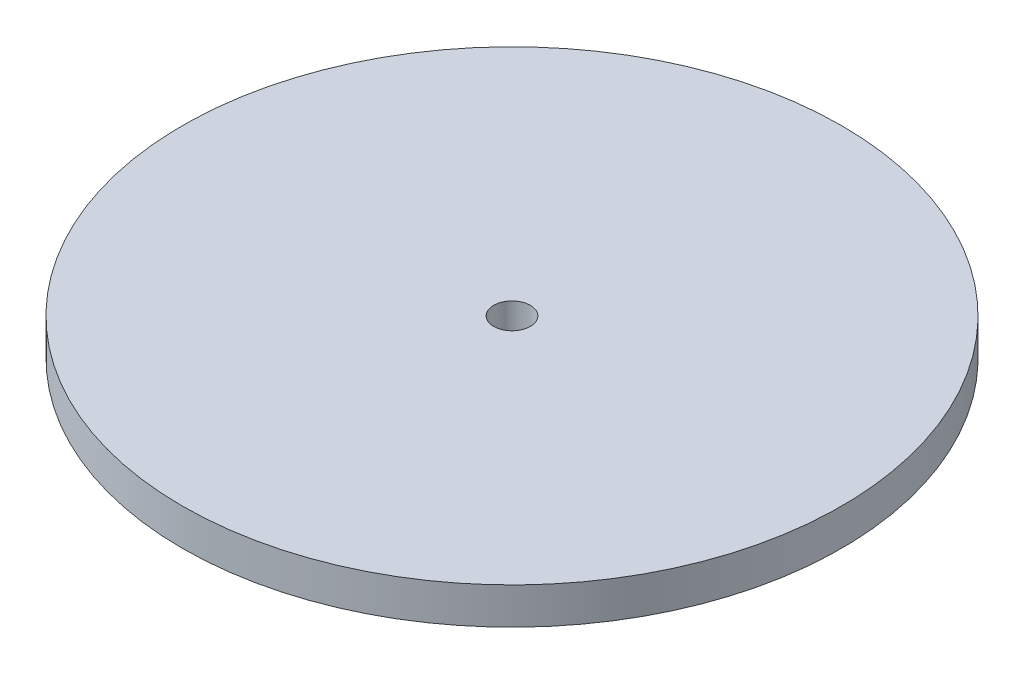
ISO-10303-21;
HEADER;
FILE_DESCRIPTION(('STEP AP214'),'2;1');
FILE_NAME('part.step','',(''),(''),'','','');
FILE_SCHEMA(('AUTOMOTIVE_DESIGN { 1 0 10303 214 1 1 1 1 }'));
ENDSEC;
DATA;
#1=APPLICATION_CONTEXT('core data for automotive mechanical design processes');
#2=APPLICATION_PROTOCOL_DEFINITION('international standard','automotive_design',2000,#1);
#3=PRODUCT_CONTEXT('',#1,'mechanical');
#4=PRODUCT('Part','Part','',(#3));
#5=PRODUCT_RELATED_PRODUCT_CATEGORY('part','',(#4));
#6=PRODUCT_DEFINITION_FORMATION('','',#4);
#7=PRODUCT_DEFINITION_CONTEXT('part definition',#1,'design');
#8=PRODUCT_DEFINITION('design','',#6,#7);
#9=PRODUCT_DEFINITION_SHAPE('','',#8);
#10=(LENGTH_UNIT() NAMED_UNIT(*) SI_UNIT(.MILLI.,.METRE.));
#11=(NAMED_UNIT(*) PLANE_ANGLE_UNIT() SI_UNIT($,.RADIAN.));
#12=(NAMED_UNIT(*) SI_UNIT($,.STERADIAN.) SOLID_ANGLE_UNIT());
#13=UNCERTAINTY_MEASURE_WITH_UNIT(LENGTH_MEASURE(1.E-05),#10,'distance_accuracy_value','');
#14=(GEOMETRIC_REPRESENTATION_CONTEXT(3) GLOBAL_UNCERTAINTY_ASSIGNED_CONTEXT((#13)) GLOBAL_UNIT_ASSIGNED_CONTEXT((#10,
#11,#12)) REPRESENTATION_CONTEXT('',''));
#15=CARTESIAN_POINT('',(0.,0.,0.));
#16=DIRECTION('',(0.,0.,1.));
#17=DIRECTION('',(1.,0.,0.));
#18=AXIS2_PLACEMENT_3D('',#15,#16,#17);
#19=CARTESIAN_POINT('',(0.,10.,0.));
#20=DIRECTION('',(0.,-1.,0.));
#21=DIRECTION('',(0.,0.,-1.));
#22=AXIS2_PLACEMENT_3D('',#19,#20,#21);
#23=CYLINDRICAL_SURFACE('',#22,90.);
#24=CARTESIAN_POINT('',(0.,10.,0.));
#25=DIRECTION('',(0.,1.,0.));
#26=DIRECTION('',(0.,0.,1.));
#27=AXIS2_PLACEMENT_3D('',#24,#25,#26);
#28=CIRCLE('',#27,90.);
#29=CARTESIAN_POINT('',(0.,10.,90.));
#30=VERTEX_POINT('',#29);
#31=EDGE_CURVE('E10',#30,#30,#28,.T.);
#32=ORIENTED_EDGE('',*,*,#31,.F.);
#33=EDGE_LOOP('',(#32));
#34=FACE_BOUND('',#33,.T.);
#35=CARTESIAN_POINT('',(0.,0.,0.));
#36=DIRECTION('',(0.,1.,0.));
#37=DIRECTION('',(0.,0.,1.));
#38=AXIS2_PLACEMENT_3D('',#35,#36,#37);
#39=CIRCLE('',#38,90.);
#40=CARTESIAN_POINT('',(0.,0.,90.));
#41=VERTEX_POINT('',#40);
#42=EDGE_CURVE('E41',#41,#41,#39,.T.);
#43=ORIENTED_EDGE('',*,*,#42,.T.);
#44=EDGE_LOOP('',(#43));
#45=FACE_BOUND('',#44,.T.);
#46=ADVANCED_FACE('F38',(#34,#45),#23,.T.);
#47=CARTESIAN_POINT('',(0.,10.,0.));
#48=DIRECTION('',(0.,1.,0.));
#49=DIRECTION('',(0.,0.,1.));
#50=AXIS2_PLACEMENT_3D('',#47,#48,#49);
#51=PLANE('',#50);
#52=CARTESIAN_POINT('',(0.,10.,0.));
#53=DIRECTION('',(0.,1.,0.));
#54=DIRECTION('',(0.,0.,1.));
#55=AXIS2_PLACEMENT_3D('',#52,#53,#54);
#56=CIRCLE('',#55,5.);
#57=CARTESIAN_POINT('',(0.,10.,5.));
#58=VERTEX_POINT('',#57);
#59=EDGE_CURVE('E52',#58,#58,#56,.T.);
#60=ORIENTED_EDGE('',*,*,#59,.F.);
#61=EDGE_LOOP('',(#60));
#62=FACE_BOUND('',#61,.T.);
#63=ORIENTED_EDGE('',*,*,#31,.T.);
#64=EDGE_LOOP('',(#63));
#65=FACE_BOUND('',#64,.T.);
#66=ADVANCED_FACE('F69',(#62,#65),#51,.T.);
#67=CARTESIAN_POINT('',(0.,0.,0.));
#68=DIRECTION('',(0.,1.,0.));
#69=DIRECTION('',(0.,0.,1.));
#70=AXIS2_PLACEMENT_3D('',#67,#68,#69);
#71=PLANE('',#70);
#72=CARTESIAN_POINT('',(0.,0.,0.));
#73=DIRECTION('',(0.,1.,0.));
#74=DIRECTION('',(0.,0.,1.));
#75=AXIS2_PLACEMENT_3D('',#72,#73,#74);
#76=CIRCLE('',#75,5.);
#77=CARTESIAN_POINT('',(0.,0.,5.));
#78=VERTEX_POINT('',#77);
#79=EDGE_CURVE('E50',#78,#78,#76,.T.);
#80=ORIENTED_EDGE('',*,*,#79,.T.);
#81=EDGE_LOOP('',(#80));
#82=FACE_BOUND('',#81,.T.);
#83=ORIENTED_EDGE('',*,*,#42,.F.);
#84=EDGE_LOOP('',(#83));
#85=FACE_BOUND('',#84,.T.);
#86=ADVANCED_FACE('F60',(#82,#85),#71,.F.);
#87=CARTESIAN_POINT('',(0.,0.,0.));
#88=DIRECTION('',(0.,1.,0.));
#89=DIRECTION('',(0.,0.,1.));
#90=AXIS2_PLACEMENT_3D('',#87,#88,#89);
#91=CYLINDRICAL_SURFACE('',#90,5.);
#92=ORIENTED_EDGE('',*,*,#79,.F.);
#93=EDGE_LOOP('',(#92));
#94=FACE_BOUND('',#93,.T.);
#95=ORIENTED_EDGE('',*,*,#59,.T.);
#96=EDGE_LOOP('',(#95));
#97=FACE_BOUND('',#96,.T.);
#98=ADVANCED_FACE('F63',(#94,#97),#91,.F.);
#99=CLOSED_SHELL('',(#46,#66,#86,#98));
#100=MANIFOLD_SOLID_BREP('B2',#99);
#101=ADVANCED_BREP_SHAPE_REPRESENTATION('',(#18,#100),#14);
#102=SHAPE_DEFINITION_REPRESENTATION(#9,#101);
ENDSEC;
END-ISO-10303-21;
